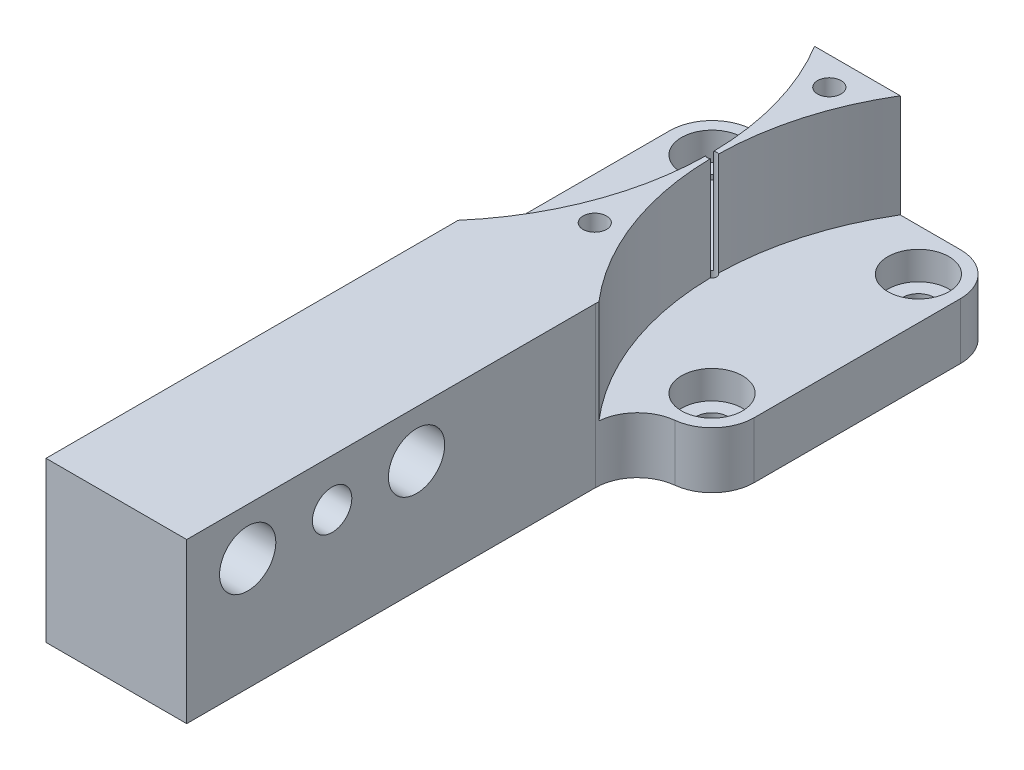
ISO-10303-21;
HEADER;
FILE_DESCRIPTION(('STEP AP214'),'2;1');
FILE_NAME('part.step','',(''),(''),'','','');
FILE_SCHEMA(('AUTOMOTIVE_DESIGN { 1 0 10303 214 1 1 1 1 }'));
ENDSEC;
DATA;
#1=APPLICATION_CONTEXT('core data for automotive mechanical design processes');
#2=APPLICATION_PROTOCOL_DEFINITION('international standard','automotive_design',2000,#1);
#3=PRODUCT_CONTEXT('',#1,'mechanical');
#4=PRODUCT('Part','Part','',(#3));
#5=PRODUCT_RELATED_PRODUCT_CATEGORY('part','',(#4));
#6=PRODUCT_DEFINITION_FORMATION('','',#4);
#7=PRODUCT_DEFINITION_CONTEXT('part definition',#1,'design');
#8=PRODUCT_DEFINITION('design','',#6,#7);
#9=PRODUCT_DEFINITION_SHAPE('','',#8);
#10=(LENGTH_UNIT() NAMED_UNIT(*) SI_UNIT(.MILLI.,.METRE.));
#11=(NAMED_UNIT(*) PLANE_ANGLE_UNIT() SI_UNIT($,.RADIAN.));
#12=(NAMED_UNIT(*) SI_UNIT($,.STERADIAN.) SOLID_ANGLE_UNIT());
#13=UNCERTAINTY_MEASURE_WITH_UNIT(LENGTH_MEASURE(1.E-05),#10,'distance_accuracy_value','');
#14=(GEOMETRIC_REPRESENTATION_CONTEXT(3) GLOBAL_UNCERTAINTY_ASSIGNED_CONTEXT((#13)) GLOBAL_UNIT_ASSIGNED_CONTEXT((#10,
#11,#12)) REPRESENTATION_CONTEXT('',''));
#15=CARTESIAN_POINT('',(0.,0.,0.));
#16=DIRECTION('',(0.,0.,1.));
#17=DIRECTION('',(1.,0.,0.));
#18=AXIS2_PLACEMENT_3D('',#15,#16,#17);
#19=CARTESIAN_POINT('',(30.25,11.,0.));
#20=DIRECTION('',(0.,-1.,0.));
#21=DIRECTION('',(0.,0.,-1.));
#22=AXIS2_PLACEMENT_3D('',#19,#20,#21);
#23=CYLINDRICAL_SURFACE('',#22,30.);
#24=DIRECTION('',(0.,-1.,0.));
#25=VECTOR('',#24,1.);
#26=CARTESIAN_POINT('',(4.56440092191735,11.,-15.5));
#27=LINE('',#26,#25);
#28=CARTESIAN_POINT('',(4.56440092191735,11.,-15.5));
#29=VERTEX_POINT('',#28);
#30=CARTESIAN_POINT('',(4.56440092191735,0.,-15.5));
#31=VERTEX_POINT('',#30);
#32=EDGE_CURVE('E393',#29,#31,#27,.T.);
#33=ORIENTED_EDGE('',*,*,#32,.F.);
#34=CARTESIAN_POINT('',(30.25,11.,0.));
#35=DIRECTION('',(0.,-1.,0.));
#36=DIRECTION('',(0.,0.,1.));
#37=AXIS2_PLACEMENT_3D('',#34,#35,#36);
#38=CIRCLE('',#37,30.);
#39=CARTESIAN_POINT('',(0.253099173553696,11.,-0.431208543916322));
#40=VERTEX_POINT('',#39);
#41=EDGE_CURVE('E526',#40,#29,#38,.T.);
#42=ORIENTED_EDGE('',*,*,#41,.F.);
#43=DIRECTION('',(0.,1.,0.));
#44=VECTOR('',#43,1.);
#45=CARTESIAN_POINT('',(0.253099173553695,2.5,-0.43120854391632));
#46=LINE('',#45,#44);
#47=CARTESIAN_POINT('',(0.25309917355372,0.,-0.431208543916362));
#48=VERTEX_POINT('',#47);
#49=EDGE_CURVE('E445',#40,#48,#46,.F.);
#50=ORIENTED_EDGE('',*,*,#49,.T.);
#51=CARTESIAN_POINT('',(30.25,0.,0.));
#52=DIRECTION('',(0.,-1.,0.));
#53=DIRECTION('',(0.,0.,1.));
#54=AXIS2_PLACEMENT_3D('',#51,#52,#53);
#55=CIRCLE('',#54,30.);
#56=EDGE_CURVE('E513',#48,#31,#55,.T.);
#57=ORIENTED_EDGE('',*,*,#56,.T.);
#58=EDGE_LOOP('',(#33,#42,#50,#57));
#59=FACE_BOUND('',#58,.T.);
#60=ADVANCED_FACE('F56',(#59),#23,.F.);
#61=CARTESIAN_POINT('',(30.25,11.,0.));
#62=DIRECTION('',(0.,1.,0.));
#63=DIRECTION('',(0.,0.,1.));
#64=AXIS2_PLACEMENT_3D('',#61,#62,#63);
#65=PLANE('',#64);
#66=CARTESIAN_POINT('',(0.,11.,-12.5));
#67=DIRECTION('',(0.,1.,0.));
#68=DIRECTION('',(0.,0.,1.));
#69=AXIS2_PLACEMENT_3D('',#66,#67,#68);
#70=CIRCLE('',#69,1.25);
#71=CARTESIAN_POINT('',(0.,11.,-11.25));
#72=VERTEX_POINT('',#71);
#73=EDGE_CURVE('E585',#72,#72,#70,.T.);
#74=ORIENTED_EDGE('',*,*,#73,.F.);
#75=EDGE_LOOP('',(#74));
#76=FACE_BOUND('',#75,.T.);
#77=ORIENTED_EDGE('',*,*,#41,.T.);
#78=DIRECTION('',(-1.,0.,0.));
#79=VECTOR('',#78,1.);
#80=CARTESIAN_POINT('',(-11.,11.,-15.5));
#81=LINE('',#80,#79);
#82=CARTESIAN_POINT('',(-4.56440092191735,11.,-15.5));
#83=VERTEX_POINT('',#82);
#84=EDGE_CURVE('E563',#29,#83,#81,.T.);
#85=ORIENTED_EDGE('',*,*,#84,.T.);
#86=CARTESIAN_POINT('',(-30.25,11.,0.));
#87=DIRECTION('',(0.,-1.,0.));
#88=DIRECTION('',(0.,0.,1.));
#89=AXIS2_PLACEMENT_3D('',#86,#87,#88);
#90=CIRCLE('',#89,30.);
#91=CARTESIAN_POINT('',(-0.25309917355372,11.,-0.431208543916319));
#92=VERTEX_POINT('',#91);
#93=EDGE_CURVE('E535',#83,#92,#90,.T.);
#94=ORIENTED_EDGE('',*,*,#93,.T.);
#95=CARTESIAN_POINT('',(0.,11.,0.));
#96=DIRECTION('',(0.,1.,0.));
#97=DIRECTION('',(0.,0.,1.));
#98=AXIS2_PLACEMENT_3D('',#95,#96,#97);
#99=CIRCLE('',#98,0.499999999999998);
#100=EDGE_CURVE('E432',#40,#92,#99,.T.);
#101=ORIENTED_EDGE('',*,*,#100,.F.);
#102=EDGE_LOOP('',(#77,#85,#94,#101));
#103=FACE_BOUND('',#102,.T.);
#104=ADVANCED_FACE('F595',(#76,#103),#65,.T.);
#105=CARTESIAN_POINT('',(-30.25,11.,0.));
#106=DIRECTION('',(0.,-1.,0.));
#107=DIRECTION('',(0.,0.,-1.));
#108=AXIS2_PLACEMENT_3D('',#105,#106,#107);
#109=CYLINDRICAL_SURFACE('',#108,30.);
#110=DIRECTION('',(0.,1.,0.));
#111=VECTOR('',#110,1.);
#112=CARTESIAN_POINT('',(-7.51527842224712,2.5,19.5737690489609));
#113=LINE('',#112,#111);
#114=CARTESIAN_POINT('',(-7.51527842224712,11.,19.5737690489609));
#115=VERTEX_POINT('',#114);
#116=CARTESIAN_POINT('',(-7.51527842224713,0.,19.5737690489609));
#117=VERTEX_POINT('',#116);
#118=EDGE_CURVE('E382',#115,#117,#113,.F.);
#119=ORIENTED_EDGE('',*,*,#118,.F.);
#120=CARTESIAN_POINT('',(-0.253099173553696,11.,0.431208543916322));
#121=VERTEX_POINT('',#120);
#122=EDGE_CURVE('E532',#121,#115,#90,.T.);
#123=ORIENTED_EDGE('',*,*,#122,.F.);
#124=DIRECTION('',(0.,1.,0.));
#125=VECTOR('',#124,1.);
#126=CARTESIAN_POINT('',(-0.253099173553695,2.5,0.43120854391632));
#127=LINE('',#126,#125);
#128=CARTESIAN_POINT('',(-0.25309917355372,0.,0.431208543916362));
#129=VERTEX_POINT('',#128);
#130=EDGE_CURVE('E65',#121,#129,#127,.F.);
#131=ORIENTED_EDGE('',*,*,#130,.T.);
#132=CARTESIAN_POINT('',(-30.25,0.,0.));
#133=DIRECTION('',(0.,-1.,0.));
#134=DIRECTION('',(0.,0.,1.));
#135=AXIS2_PLACEMENT_3D('',#132,#133,#134);
#136=CIRCLE('',#135,30.);
#137=EDGE_CURVE('E520',#129,#117,#136,.T.);
#138=ORIENTED_EDGE('',*,*,#137,.T.);
#139=EDGE_LOOP('',(#119,#123,#131,#138));
#140=FACE_BOUND('',#139,.T.);
#141=ADVANCED_FACE('F598',(#140),#109,.F.);
#142=CARTESIAN_POINT('',(0.,0.,0.));
#143=DIRECTION('',(0.,1.,0.));
#144=DIRECTION('',(0.,0.,1.));
#145=AXIS2_PLACEMENT_3D('',#142,#143,#144);
#146=PLANE('',#145);
#147=CARTESIAN_POINT('',(-11.,0.,-11.));
#148=DIRECTION('',(0.,1.,0.));
#149=DIRECTION('',(0.,0.,1.));
#150=AXIS2_PLACEMENT_3D('',#147,#148,#149);
#151=CIRCLE('',#150,3.25);
#152=CARTESIAN_POINT('',(-11.,0.,-7.75));
#153=VERTEX_POINT('',#152);
#154=EDGE_CURVE('E449',#153,#153,#151,.T.);
#155=ORIENTED_EDGE('',*,*,#154,.F.);
#156=EDGE_LOOP('',(#155));
#157=FACE_BOUND('',#156,.T.);
#158=CARTESIAN_POINT('',(-11.,0.,11.));
#159=DIRECTION('',(0.,1.,0.));
#160=DIRECTION('',(0.,0.,1.));
#161=AXIS2_PLACEMENT_3D('',#158,#159,#160);
#162=CIRCLE('',#161,3.25);
#163=CARTESIAN_POINT('',(-11.,0.,14.25));
#164=VERTEX_POINT('',#163);
#165=EDGE_CURVE('E497',#164,#164,#162,.T.);
#166=ORIENTED_EDGE('',*,*,#165,.F.);
#167=EDGE_LOOP('',(#166));
#168=FACE_BOUND('',#167,.T.);
#169=CARTESIAN_POINT('',(-11.,0.,11.));
#170=DIRECTION('',(0.,1.,0.));
#171=DIRECTION('',(0.,0.,1.));
#172=AXIS2_PLACEMENT_3D('',#169,#170,#171);
#173=CIRCLE('',#172,4.5);
#174=CARTESIAN_POINT('',(-15.5,0.,11.));
#175=VERTEX_POINT('',#174);
#176=CARTESIAN_POINT('',(-11.5,0.,15.4721359549996));
#177=VERTEX_POINT('',#176);
#178=EDGE_CURVE('E414',#175,#177,#173,.T.);
#179=ORIENTED_EDGE('',*,*,#178,.T.);
#180=CARTESIAN_POINT('',(-12.,0.,19.9442719099992));
#181=DIRECTION('',(0.,1.,0.));
#182=DIRECTION('',(0.,0.,1.));
#183=AXIS2_PLACEMENT_3D('',#180,#181,#182);
#184=CIRCLE('',#183,4.5);
#185=EDGE_CURVE('E311',#177,#117,#184,.F.);
#186=ORIENTED_EDGE('',*,*,#185,.T.);
#187=ORIENTED_EDGE('',*,*,#137,.F.);
#188=CARTESIAN_POINT('',(0.,0.,0.));
#189=DIRECTION('',(0.,1.,0.));
#190=DIRECTION('',(0.,0.,1.));
#191=AXIS2_PLACEMENT_3D('',#188,#189,#190);
#192=CIRCLE('',#191,0.499999999999997);
#193=CARTESIAN_POINT('',(-0.25309917355372,0.,-0.431208543916319));
#194=VERTEX_POINT('',#193);
#195=EDGE_CURVE('E436',#194,#129,#192,.T.);
#196=ORIENTED_EDGE('',*,*,#195,.F.);
#197=CARTESIAN_POINT('',(-4.56440092191735,0.,-15.5));
#198=VERTEX_POINT('',#197);
#199=EDGE_CURVE('E523',#198,#194,#136,.T.);
#200=ORIENTED_EDGE('',*,*,#199,.F.);
#201=DIRECTION('',(-1.,0.,0.));
#202=VECTOR('',#201,1.);
#203=CARTESIAN_POINT('',(0.,0.,-15.5));
#204=LINE('',#203,#202);
#205=CARTESIAN_POINT('',(-11.,0.,-15.5));
#206=VERTEX_POINT('',#205);
#207=EDGE_CURVE('E385',#198,#206,#204,.T.);
#208=ORIENTED_EDGE('',*,*,#207,.T.);
#209=CARTESIAN_POINT('',(-11.,0.,-11.));
#210=DIRECTION('',(0.,1.,0.));
#211=DIRECTION('',(0.,0.,1.));
#212=AXIS2_PLACEMENT_3D('',#209,#210,#211);
#213=CIRCLE('',#212,4.5);
#214=CARTESIAN_POINT('',(-15.5,0.,-11.));
#215=VERTEX_POINT('',#214);
#216=EDGE_CURVE('E406',#206,#215,#213,.T.);
#217=ORIENTED_EDGE('',*,*,#216,.T.);
#218=DIRECTION('',(0.,0.,1.));
#219=VECTOR('',#218,1.);
#220=CARTESIAN_POINT('',(-15.5,0.,0.));
#221=LINE('',#220,#219);
#222=EDGE_CURVE('E410',#215,#175,#221,.T.);
#223=ORIENTED_EDGE('',*,*,#222,.T.);
#224=EDGE_LOOP('',(#179,#186,#187,#196,#200,#208,#217,#223));
#225=FACE_BOUND('',#224,.T.);
#226=ADVANCED_FACE('F620',(#157,#168,#225),#146,.T.);
#227=CARTESIAN_POINT('',(0.,-6.,0.));
#228=DIRECTION('',(0.,1.,0.));
#229=DIRECTION('',(0.,0.,1.));
#230=AXIS2_PLACEMENT_3D('',#227,#228,#229);
#231=PLANE('',#230);
#232=CARTESIAN_POINT('',(0.,-6.,-12.5));
#233=DIRECTION('',(0.,1.,0.));
#234=DIRECTION('',(0.,0.,1.));
#235=AXIS2_PLACEMENT_3D('',#232,#233,#234);
#236=CIRCLE('',#235,1.25);
#237=CARTESIAN_POINT('',(0.,-6.,-11.25));
#238=VERTEX_POINT('',#237);
#239=EDGE_CURVE('E580',#238,#238,#236,.T.);
#240=ORIENTED_EDGE('',*,*,#239,.T.);
#241=EDGE_LOOP('',(#240));
#242=FACE_BOUND('',#241,.T.);
#243=CARTESIAN_POINT('',(0.,-6.,12.5));
#244=DIRECTION('',(0.,1.,0.));
#245=DIRECTION('',(0.,0.,1.));
#246=AXIS2_PLACEMENT_3D('',#243,#244,#245);
#247=CIRCLE('',#246,1.25);
#248=CARTESIAN_POINT('',(0.,-6.,13.75));
#249=VERTEX_POINT('',#248);
#250=EDGE_CURVE('E282',#249,#249,#247,.T.);
#251=ORIENTED_EDGE('',*,*,#250,.T.);
#252=EDGE_LOOP('',(#251));
#253=FACE_BOUND('',#252,.T.);
#254=CARTESIAN_POINT('',(-11.,-6.,11.));
#255=DIRECTION('',(0.,1.,0.));
#256=DIRECTION('',(0.,0.,1.));
#257=AXIS2_PLACEMENT_3D('',#254,#255,#256);
#258=CIRCLE('',#257,1.7);
#259=CARTESIAN_POINT('',(-11.,-6.,12.7));
#260=VERTEX_POINT('',#259);
#261=EDGE_CURVE('E509',#260,#260,#258,.T.);
#262=ORIENTED_EDGE('',*,*,#261,.T.);
#263=EDGE_LOOP('',(#262));
#264=FACE_BOUND('',#263,.T.);
#265=CARTESIAN_POINT('',(11.,-6.,11.));
#266=DIRECTION('',(0.,1.,0.));
#267=DIRECTION('',(0.,0.,1.));
#268=AXIS2_PLACEMENT_3D('',#265,#266,#267);
#269=CIRCLE('',#268,1.7);
#270=CARTESIAN_POINT('',(11.,-6.,12.7));
#271=VERTEX_POINT('',#270);
#272=EDGE_CURVE('E493',#271,#271,#269,.T.);
#273=ORIENTED_EDGE('',*,*,#272,.T.);
#274=EDGE_LOOP('',(#273));
#275=FACE_BOUND('',#274,.T.);
#276=CARTESIAN_POINT('',(11.,-6.,-11.));
#277=DIRECTION('',(0.,1.,0.));
#278=DIRECTION('',(0.,0.,1.));
#279=AXIS2_PLACEMENT_3D('',#276,#277,#278);
#280=CIRCLE('',#279,1.7);
#281=CARTESIAN_POINT('',(11.,-6.,-9.3));
#282=VERTEX_POINT('',#281);
#283=EDGE_CURVE('E477',#282,#282,#280,.T.);
#284=ORIENTED_EDGE('',*,*,#283,.T.);
#285=EDGE_LOOP('',(#284));
#286=FACE_BOUND('',#285,.T.);
#287=CARTESIAN_POINT('',(-11.,-6.,-11.));
#288=DIRECTION('',(0.,1.,0.));
#289=DIRECTION('',(0.,0.,1.));
#290=AXIS2_PLACEMENT_3D('',#287,#288,#289);
#291=CIRCLE('',#290,1.7);
#292=CARTESIAN_POINT('',(-11.,-6.,-9.3));
#293=VERTEX_POINT('',#292);
#294=EDGE_CURVE('E461',#293,#293,#291,.T.);
#295=ORIENTED_EDGE('',*,*,#294,.T.);
#296=EDGE_LOOP('',(#295));
#297=FACE_BOUND('',#296,.T.);
#298=CARTESIAN_POINT('',(0.,-6.,0.));
#299=DIRECTION('',(0.,-1.,0.));
#300=DIRECTION('',(0.,0.,-1.));
#301=AXIS2_PLACEMENT_3D('',#298,#299,#300);
#302=CIRCLE('',#301,1.5);
#303=CARTESIAN_POINT('',(0.,-6.,-1.5));
#304=VERTEX_POINT('',#303);
#305=EDGE_CURVE('E417',#304,#304,#302,.T.);
#306=ORIENTED_EDGE('',*,*,#305,.F.);
#307=EDGE_LOOP('',(#306));
#308=FACE_BOUND('',#307,.T.);
#309=DIRECTION('',(1.,0.,0.));
#310=VECTOR('',#309,1.);
#311=CARTESIAN_POINT('',(-7.50000000000003,-6.,63.5));
#312=LINE('',#311,#310);
#313=CARTESIAN_POINT('',(-7.50000000000003,-6.,63.5));
#314=VERTEX_POINT('',#313);
#315=CARTESIAN_POINT('',(7.49999999999997,-6.,63.5));
#316=VERTEX_POINT('',#315);
#317=EDGE_CURVE('E72',#314,#316,#312,.T.);
#318=ORIENTED_EDGE('',*,*,#317,.F.);
#319=DIRECTION('',(0.,0.,1.));
#320=VECTOR('',#319,1.);
#321=CARTESIAN_POINT('',(-7.50000000000003,-6.,63.5));
#322=LINE('',#321,#320);
#323=CARTESIAN_POINT('',(-7.50000000000002,-6.,19.9442719099992));
#324=VERTEX_POINT('',#323);
#325=EDGE_CURVE('E265',#324,#314,#322,.T.);
#326=ORIENTED_EDGE('',*,*,#325,.F.);
#327=CARTESIAN_POINT('',(-12.,-6.,19.9442719099992));
#328=DIRECTION('',(0.,-1.,0.));
#329=DIRECTION('',(0.,0.,1.));
#330=AXIS2_PLACEMENT_3D('',#327,#328,#329);
#331=CIRCLE('',#330,4.5);
#332=CARTESIAN_POINT('',(-11.5,-6.,15.4721359549996));
#333=VERTEX_POINT('',#332);
#334=EDGE_CURVE('E260',#333,#324,#331,.T.);
#335=ORIENTED_EDGE('',*,*,#334,.F.);
#336=CARTESIAN_POINT('',(-11.,-6.,11.));
#337=DIRECTION('',(0.,1.,0.));
#338=DIRECTION('',(0.,0.,1.));
#339=AXIS2_PLACEMENT_3D('',#336,#337,#338);
#340=CIRCLE('',#339,4.5);
#341=CARTESIAN_POINT('',(-15.5,-6.,11.));
#342=VERTEX_POINT('',#341);
#343=EDGE_CURVE('E256',#342,#333,#340,.T.);
#344=ORIENTED_EDGE('',*,*,#343,.F.);
#345=DIRECTION('',(0.,0.,1.));
#346=VECTOR('',#345,1.);
#347=CARTESIAN_POINT('',(-15.5,-6.,-11.));
#348=LINE('',#347,#346);
#349=CARTESIAN_POINT('',(-15.5,-6.,-11.));
#350=VERTEX_POINT('',#349);
#351=EDGE_CURVE('E248',#350,#342,#348,.T.);
#352=ORIENTED_EDGE('',*,*,#351,.F.);
#353=CARTESIAN_POINT('',(-11.,-6.,-11.));
#354=DIRECTION('',(0.,1.,0.));
#355=DIRECTION('',(0.,0.,1.));
#356=AXIS2_PLACEMENT_3D('',#353,#354,#355);
#357=CIRCLE('',#356,4.5);
#358=CARTESIAN_POINT('',(-11.,-6.,-15.5));
#359=VERTEX_POINT('',#358);
#360=EDGE_CURVE('E243',#359,#350,#357,.T.);
#361=ORIENTED_EDGE('',*,*,#360,.F.);
#362=DIRECTION('',(-1.,0.,0.));
#363=VECTOR('',#362,1.);
#364=CARTESIAN_POINT('',(-11.,-6.,-15.5));
#365=LINE('',#364,#363);
#366=CARTESIAN_POINT('',(11.,-6.,-15.5));
#367=VERTEX_POINT('',#366);
#368=EDGE_CURVE('E238',#367,#359,#365,.T.);
#369=ORIENTED_EDGE('',*,*,#368,.F.);
#370=CARTESIAN_POINT('',(11.,-6.,-11.));
#371=DIRECTION('',(0.,1.,0.));
#372=DIRECTION('',(0.,0.,1.));
#373=AXIS2_PLACEMENT_3D('',#370,#371,#372);
#374=CIRCLE('',#373,4.5);
#375=CARTESIAN_POINT('',(15.5,-6.,-11.));
#376=VERTEX_POINT('',#375);
#377=EDGE_CURVE('E223',#376,#367,#374,.T.);
#378=ORIENTED_EDGE('',*,*,#377,.F.);
#379=DIRECTION('',(0.,0.,-1.));
#380=VECTOR('',#379,1.);
#381=CARTESIAN_POINT('',(15.5,-6.,-11.));
#382=LINE('',#381,#380);
#383=CARTESIAN_POINT('',(15.5,-6.,11.));
#384=VERTEX_POINT('',#383);
#385=EDGE_CURVE('E219',#384,#376,#382,.T.);
#386=ORIENTED_EDGE('',*,*,#385,.F.);
#387=CARTESIAN_POINT('',(11.,-6.,11.));
#388=DIRECTION('',(0.,1.,0.));
#389=DIRECTION('',(0.,0.,1.));
#390=AXIS2_PLACEMENT_3D('',#387,#388,#389);
#391=CIRCLE('',#390,4.5);
#392=CARTESIAN_POINT('',(11.5,-6.,15.4721359549996));
#393=VERTEX_POINT('',#392);
#394=EDGE_CURVE('E198',#393,#384,#391,.T.);
#395=ORIENTED_EDGE('',*,*,#394,.F.);
#396=CARTESIAN_POINT('',(12.,-6.,19.9442719099992));
#397=DIRECTION('',(0.,-1.,0.));
#398=DIRECTION('',(0.,0.,1.));
#399=AXIS2_PLACEMENT_3D('',#396,#397,#398);
#400=CIRCLE('',#399,4.5);
#401=CARTESIAN_POINT('',(7.49999999999998,-6.,19.9442719099992));
#402=VERTEX_POINT('',#401);
#403=EDGE_CURVE('E208',#402,#393,#400,.T.);
#404=ORIENTED_EDGE('',*,*,#403,.F.);
#405=DIRECTION('',(0.,0.,-1.));
#406=VECTOR('',#405,1.);
#407=CARTESIAN_POINT('',(7.49999999999997,-6.,63.5));
#408=LINE('',#407,#406);
#409=EDGE_CURVE('E214',#316,#402,#408,.T.);
#410=ORIENTED_EDGE('',*,*,#409,.F.);
#411=EDGE_LOOP('',(#318,#326,#335,#344,#352,#361,#369,#378,#386,#395,#404,#410));
#412=FACE_BOUND('',#411,.T.);
#413=ADVANCED_FACE('F216',(#242,#253,#264,#275,#286,#297,#308,#412),#231,.F.);
#414=DIRECTION('',(0.,1.,0.));
#415=VECTOR('',#414,1.);
#416=CARTESIAN_POINT('',(7.51527842224709,2.5,19.5737690489608));
#417=LINE('',#416,#415);
#418=CARTESIAN_POINT('',(7.51527842224709,0.,19.5737690489608));
#419=VERTEX_POINT('',#418);
#420=CARTESIAN_POINT('',(7.51527842224709,11.,19.5737690489608));
#421=VERTEX_POINT('',#420);
#422=EDGE_CURVE('E374',#419,#421,#417,.T.);
#423=ORIENTED_EDGE('',*,*,#422,.F.);
#424=CARTESIAN_POINT('',(0.25309917355372,0.,0.431208543916329));
#425=VERTEX_POINT('',#424);
#426=EDGE_CURVE('E517',#419,#425,#55,.T.);
#427=ORIENTED_EDGE('',*,*,#426,.T.);
#428=DIRECTION('',(0.,1.,0.));
#429=VECTOR('',#428,1.);
#430=CARTESIAN_POINT('',(0.253099173553695,2.5,0.43120854391632));
#431=LINE('',#430,#429);
#432=CARTESIAN_POINT('',(0.253099173553696,11.,0.431208543916322));
#433=VERTEX_POINT('',#432);
#434=EDGE_CURVE('E438',#425,#433,#431,.T.);
#435=ORIENTED_EDGE('',*,*,#434,.T.);
#436=EDGE_CURVE('E529',#421,#433,#38,.T.);
#437=ORIENTED_EDGE('',*,*,#436,.F.);
#438=EDGE_LOOP('',(#423,#427,#435,#437));
#439=FACE_BOUND('',#438,.T.);
#440=ADVANCED_FACE('F632',(#439),#23,.F.);
#441=DIRECTION('',(0.,-1.,0.));
#442=VECTOR('',#441,1.);
#443=CARTESIAN_POINT('',(-4.56440092191735,11.,-15.5));
#444=LINE('',#443,#442);
#445=EDGE_CURVE('E12',#198,#83,#444,.F.);
#446=ORIENTED_EDGE('',*,*,#445,.F.);
#447=ORIENTED_EDGE('',*,*,#199,.T.);
#448=DIRECTION('',(0.,1.,0.));
#449=VECTOR('',#448,1.);
#450=CARTESIAN_POINT('',(-0.253099173553695,2.5,-0.43120854391632));
#451=LINE('',#450,#449);
#452=EDGE_CURVE('E538',#194,#92,#451,.T.);
#453=ORIENTED_EDGE('',*,*,#452,.T.);
#454=ORIENTED_EDGE('',*,*,#93,.F.);
#455=EDGE_LOOP('',(#446,#447,#453,#454));
#456=FACE_BOUND('',#455,.T.);
#457=ADVANCED_FACE('F624',(#456),#109,.F.);
#458=CARTESIAN_POINT('',(0.,11.,12.5));
#459=DIRECTION('',(0.,1.,0.));
#460=DIRECTION('',(0.,0.,1.));
#461=AXIS2_PLACEMENT_3D('',#458,#459,#460);
#462=CIRCLE('',#461,1.25);
#463=CARTESIAN_POINT('',(0.,11.,13.75));
#464=VERTEX_POINT('',#463);
#465=EDGE_CURVE('E575',#464,#464,#462,.T.);
#466=ORIENTED_EDGE('',*,*,#465,.F.);
#467=EDGE_LOOP('',(#466));
#468=FACE_BOUND('',#467,.T.);
#469=ORIENTED_EDGE('',*,*,#122,.T.);
#470=CARTESIAN_POINT('',(-12.,11.,19.9442719099992));
#471=DIRECTION('',(0.,-1.,0.));
#472=DIRECTION('',(0.,0.,1.));
#473=AXIS2_PLACEMENT_3D('',#470,#471,#472);
#474=CIRCLE('',#473,4.5);
#475=CARTESIAN_POINT('',(-7.50000000000002,11.,19.9442719099992));
#476=VERTEX_POINT('',#475);
#477=EDGE_CURVE('E560',#115,#476,#474,.T.);
#478=ORIENTED_EDGE('',*,*,#477,.T.);
#479=DIRECTION('',(0.,0.,1.));
#480=VECTOR('',#479,1.);
#481=CARTESIAN_POINT('',(-7.50000000000003,11.,63.5));
#482=LINE('',#481,#480);
#483=CARTESIAN_POINT('',(-7.50000000000003,11.,63.5));
#484=VERTEX_POINT('',#483);
#485=EDGE_CURVE('E281',#476,#484,#482,.T.);
#486=ORIENTED_EDGE('',*,*,#485,.T.);
#487=DIRECTION('',(1.,0.,0.));
#488=VECTOR('',#487,1.);
#489=CARTESIAN_POINT('',(-7.50000000000003,11.,63.5));
#490=LINE('',#489,#488);
#491=CARTESIAN_POINT('',(7.49999999999997,11.,63.5));
#492=VERTEX_POINT('',#491);
#493=EDGE_CURVE('E271',#484,#492,#490,.T.);
#494=ORIENTED_EDGE('',*,*,#493,.T.);
#495=DIRECTION('',(0.,0.,-1.));
#496=VECTOR('',#495,1.);
#497=CARTESIAN_POINT('',(7.49999999999997,11.,63.5));
#498=LINE('',#497,#496);
#499=CARTESIAN_POINT('',(7.49999999999998,11.,19.9442719099992));
#500=VERTEX_POINT('',#499);
#501=EDGE_CURVE('E568',#492,#500,#498,.T.);
#502=ORIENTED_EDGE('',*,*,#501,.T.);
#503=CARTESIAN_POINT('',(12.,11.,19.9442719099992));
#504=DIRECTION('',(0.,-1.,0.));
#505=DIRECTION('',(0.,0.,1.));
#506=AXIS2_PLACEMENT_3D('',#503,#504,#505);
#507=CIRCLE('',#506,4.5);
#508=EDGE_CURVE('E80',#500,#421,#507,.T.);
#509=ORIENTED_EDGE('',*,*,#508,.T.);
#510=ORIENTED_EDGE('',*,*,#436,.T.);
#511=EDGE_CURVE('E428',#121,#433,#99,.T.);
#512=ORIENTED_EDGE('',*,*,#511,.F.);
#513=EDGE_LOOP('',(#469,#478,#486,#494,#502,#509,#510,#512));
#514=FACE_BOUND('',#513,.T.);
#515=ADVANCED_FACE('F600',(#468,#514),#65,.T.);
#516=CARTESIAN_POINT('',(0.,11.,0.));
#517=DIRECTION('',(0.,1.,0.));
#518=DIRECTION('',(0.,0.,1.));
#519=AXIS2_PLACEMENT_3D('',#516,#517,#518);
#520=CYLINDRICAL_SURFACE('',#519,0.499999999999997);
#521=ORIENTED_EDGE('',*,*,#100,.T.);
#522=ORIENTED_EDGE('',*,*,#452,.F.);
#523=ORIENTED_EDGE('',*,*,#195,.T.);
#524=ORIENTED_EDGE('',*,*,#130,.F.);
#525=ORIENTED_EDGE('',*,*,#511,.T.);
#526=ORIENTED_EDGE('',*,*,#434,.F.);
#527=CARTESIAN_POINT('',(0.,0.,0.));
#528=DIRECTION('',(0.,1.,0.));
#529=DIRECTION('',(0.,0.,1.));
#530=AXIS2_PLACEMENT_3D('',#527,#528,#529);
#531=CIRCLE('',#530,0.499999999999997);
#532=EDGE_CURVE('E442',#425,#48,#531,.T.);
#533=ORIENTED_EDGE('',*,*,#532,.T.);
#534=ORIENTED_EDGE('',*,*,#49,.F.);
#535=EDGE_LOOP('',(#521,#522,#523,#524,#525,#526,#533,#534));
#536=FACE_BOUND('',#535,.T.);
#537=CARTESIAN_POINT('',(0.,-1.,0.));
#538=DIRECTION('',(0.,-1.,0.));
#539=DIRECTION('',(0.,0.,-1.));
#540=AXIS2_PLACEMENT_3D('',#537,#538,#539);
#541=CIRCLE('',#540,0.499999999999997);
#542=CARTESIAN_POINT('',(0.,-1.,-0.499999999999997));
#543=VERTEX_POINT('',#542);
#544=EDGE_CURVE('E424',#543,#543,#541,.F.);
#545=ORIENTED_EDGE('',*,*,#544,.F.);
#546=EDGE_LOOP('',(#545));
#547=FACE_BOUND('',#546,.T.);
#548=ADVANCED_FACE('F626',(#536,#547),#520,.F.);
#549=CARTESIAN_POINT('',(11.,0.,-11.));
#550=DIRECTION('',(0.,1.,0.));
#551=DIRECTION('',(0.,0.,1.));
#552=AXIS2_PLACEMENT_3D('',#549,#550,#551);
#553=CIRCLE('',#552,4.5);
#554=CARTESIAN_POINT('',(15.5,0.,-11.));
#555=VERTEX_POINT('',#554);
#556=CARTESIAN_POINT('',(11.,0.,-15.5));
#557=VERTEX_POINT('',#556);
#558=EDGE_CURVE('E402',#555,#557,#553,.T.);
#559=ORIENTED_EDGE('',*,*,#558,.T.);
#560=DIRECTION('',(-1.,0.,0.));
#561=VECTOR('',#560,1.);
#562=CARTESIAN_POINT('',(0.,0.,-15.5));
#563=LINE('',#562,#561);
#564=EDGE_CURVE('E389',#557,#31,#563,.T.);
#565=ORIENTED_EDGE('',*,*,#564,.T.);
#566=ORIENTED_EDGE('',*,*,#56,.F.);
#567=ORIENTED_EDGE('',*,*,#532,.F.);
#568=ORIENTED_EDGE('',*,*,#426,.F.);
#569=CARTESIAN_POINT('',(12.,0.,19.9442719099992));
#570=DIRECTION('',(0.,1.,0.));
#571=DIRECTION('',(0.,0.,1.));
#572=AXIS2_PLACEMENT_3D('',#569,#570,#571);
#573=CIRCLE('',#572,4.5);
#574=CARTESIAN_POINT('',(11.5,0.,15.4721359549996));
#575=VERTEX_POINT('',#574);
#576=EDGE_CURVE('E377',#419,#575,#573,.F.);
#577=ORIENTED_EDGE('',*,*,#576,.T.);
#578=CARTESIAN_POINT('',(11.,0.,11.));
#579=DIRECTION('',(0.,1.,0.));
#580=DIRECTION('',(0.,0.,1.));
#581=AXIS2_PLACEMENT_3D('',#578,#579,#580);
#582=CIRCLE('',#581,4.5);
#583=CARTESIAN_POINT('',(15.5,0.,11.));
#584=VERTEX_POINT('',#583);
#585=EDGE_CURVE('E201',#575,#584,#582,.T.);
#586=ORIENTED_EDGE('',*,*,#585,.T.);
#587=DIRECTION('',(0.,0.,-1.));
#588=VECTOR('',#587,1.);
#589=CARTESIAN_POINT('',(15.5,0.,0.));
#590=LINE('',#589,#588);
#591=EDGE_CURVE('E398',#584,#555,#590,.T.);
#592=ORIENTED_EDGE('',*,*,#591,.T.);
#593=EDGE_LOOP('',(#559,#565,#566,#567,#568,#577,#586,#592));
#594=FACE_BOUND('',#593,.T.);
#595=CARTESIAN_POINT('',(11.,0.,-11.));
#596=DIRECTION('',(0.,1.,0.));
#597=DIRECTION('',(0.,0.,1.));
#598=AXIS2_PLACEMENT_3D('',#595,#596,#597);
#599=CIRCLE('',#598,3.25);
#600=CARTESIAN_POINT('',(11.,0.,-7.75));
#601=VERTEX_POINT('',#600);
#602=EDGE_CURVE('E465',#601,#601,#599,.T.);
#603=ORIENTED_EDGE('',*,*,#602,.F.);
#604=EDGE_LOOP('',(#603));
#605=FACE_BOUND('',#604,.T.);
#606=CARTESIAN_POINT('',(11.,0.,11.));
#607=DIRECTION('',(0.,1.,0.));
#608=DIRECTION('',(0.,0.,1.));
#609=AXIS2_PLACEMENT_3D('',#606,#607,#608);
#610=CIRCLE('',#609,3.25);
#611=CARTESIAN_POINT('',(11.,0.,14.25));
#612=VERTEX_POINT('',#611);
#613=EDGE_CURVE('E481',#612,#612,#610,.T.);
#614=ORIENTED_EDGE('',*,*,#613,.F.);
#615=EDGE_LOOP('',(#614));
#616=FACE_BOUND('',#615,.T.);
#617=ADVANCED_FACE('F58',(#594,#605,#616),#146,.T.);
#618=CARTESIAN_POINT('',(-11.,0.,11.));
#619=DIRECTION('',(0.,1.,0.));
#620=DIRECTION('',(0.,0.,1.));
#621=AXIS2_PLACEMENT_3D('',#618,#619,#620);
#622=CYLINDRICAL_SURFACE('',#621,1.7);
#623=ORIENTED_EDGE('',*,*,#261,.F.);
#624=EDGE_LOOP('',(#623));
#625=FACE_BOUND('',#624,.T.);
#626=CARTESIAN_POINT('',(-11.,-3.,11.));
#627=DIRECTION('',(0.,1.,0.));
#628=DIRECTION('',(0.,0.,1.));
#629=AXIS2_PLACEMENT_3D('',#626,#627,#628);
#630=CIRCLE('',#629,1.7);
#631=CARTESIAN_POINT('',(-11.,-3.,12.7));
#632=VERTEX_POINT('',#631);
#633=EDGE_CURVE('E505',#632,#632,#630,.T.);
#634=ORIENTED_EDGE('',*,*,#633,.T.);
#635=EDGE_LOOP('',(#634));
#636=FACE_BOUND('',#635,.T.);
#637=ADVANCED_FACE('F736',(#625,#636),#622,.F.);
#638=CARTESIAN_POINT('',(-9.3,-3.,11.));
#639=DIRECTION('',(0.,-1.,0.));
#640=DIRECTION('',(0.,0.,-1.));
#641=AXIS2_PLACEMENT_3D('',#638,#639,#640);
#642=PLANE('',#641);
#643=ORIENTED_EDGE('',*,*,#633,.F.);
#644=EDGE_LOOP('',(#643));
#645=FACE_BOUND('',#644,.T.);
#646=CARTESIAN_POINT('',(-11.,-3.,11.));
#647=DIRECTION('',(0.,1.,0.));
#648=DIRECTION('',(0.,0.,1.));
#649=AXIS2_PLACEMENT_3D('',#646,#647,#648);
#650=CIRCLE('',#649,3.25);
#651=CARTESIAN_POINT('',(-11.,-3.,14.25));
#652=VERTEX_POINT('',#651);
#653=EDGE_CURVE('E501',#652,#652,#650,.T.);
#654=ORIENTED_EDGE('',*,*,#653,.T.);
#655=EDGE_LOOP('',(#654));
#656=FACE_BOUND('',#655,.T.);
#657=ADVANCED_FACE('F732',(#645,#656),#642,.F.);
#658=CARTESIAN_POINT('',(-11.,0.,11.));
#659=DIRECTION('',(0.,1.,0.));
#660=DIRECTION('',(0.,0.,1.));
#661=AXIS2_PLACEMENT_3D('',#658,#659,#660);
#662=CYLINDRICAL_SURFACE('',#661,3.25);
#663=ORIENTED_EDGE('',*,*,#653,.F.);
#664=EDGE_LOOP('',(#663));
#665=FACE_BOUND('',#664,.T.);
#666=ORIENTED_EDGE('',*,*,#165,.T.);
#667=EDGE_LOOP('',(#666));
#668=FACE_BOUND('',#667,.T.);
#669=ADVANCED_FACE('F728',(#665,#668),#662,.F.);
#670=CARTESIAN_POINT('',(11.,0.,11.));
#671=DIRECTION('',(0.,1.,0.));
#672=DIRECTION('',(0.,0.,1.));
#673=AXIS2_PLACEMENT_3D('',#670,#671,#672);
#674=CYLINDRICAL_SURFACE('',#673,1.7);
#675=ORIENTED_EDGE('',*,*,#272,.F.);
#676=EDGE_LOOP('',(#675));
#677=FACE_BOUND('',#676,.T.);
#678=CARTESIAN_POINT('',(11.,-3.,11.));
#679=DIRECTION('',(0.,1.,0.));
#680=DIRECTION('',(0.,0.,1.));
#681=AXIS2_PLACEMENT_3D('',#678,#679,#680);
#682=CIRCLE('',#681,1.7);
#683=CARTESIAN_POINT('',(11.,-3.,12.7));
#684=VERTEX_POINT('',#683);
#685=EDGE_CURVE('E489',#684,#684,#682,.T.);
#686=ORIENTED_EDGE('',*,*,#685,.T.);
#687=EDGE_LOOP('',(#686));
#688=FACE_BOUND('',#687,.T.);
#689=ADVANCED_FACE('F724',(#677,#688),#674,.F.);
#690=CARTESIAN_POINT('',(12.7,-3.,11.));
#691=DIRECTION('',(0.,-1.,0.));
#692=DIRECTION('',(0.,0.,-1.));
#693=AXIS2_PLACEMENT_3D('',#690,#691,#692);
#694=PLANE('',#693);
#695=ORIENTED_EDGE('',*,*,#685,.F.);
#696=EDGE_LOOP('',(#695));
#697=FACE_BOUND('',#696,.T.);
#698=CARTESIAN_POINT('',(11.,-3.,11.));
#699=DIRECTION('',(0.,1.,0.));
#700=DIRECTION('',(0.,0.,1.));
#701=AXIS2_PLACEMENT_3D('',#698,#699,#700);
#702=CIRCLE('',#701,3.25);
#703=CARTESIAN_POINT('',(11.,-3.,14.25));
#704=VERTEX_POINT('',#703);
#705=EDGE_CURVE('E485',#704,#704,#702,.T.);
#706=ORIENTED_EDGE('',*,*,#705,.T.);
#707=EDGE_LOOP('',(#706));
#708=FACE_BOUND('',#707,.T.);
#709=ADVANCED_FACE('F720',(#697,#708),#694,.F.);
#710=CARTESIAN_POINT('',(11.,0.,11.));
#711=DIRECTION('',(0.,1.,0.));
#712=DIRECTION('',(0.,0.,1.));
#713=AXIS2_PLACEMENT_3D('',#710,#711,#712);
#714=CYLINDRICAL_SURFACE('',#713,3.25);
#715=ORIENTED_EDGE('',*,*,#705,.F.);
#716=EDGE_LOOP('',(#715));
#717=FACE_BOUND('',#716,.T.);
#718=ORIENTED_EDGE('',*,*,#613,.T.);
#719=EDGE_LOOP('',(#718));
#720=FACE_BOUND('',#719,.T.);
#721=ADVANCED_FACE('F716',(#717,#720),#714,.F.);
#722=CARTESIAN_POINT('',(11.,0.,-11.));
#723=DIRECTION('',(0.,1.,0.));
#724=DIRECTION('',(0.,0.,1.));
#725=AXIS2_PLACEMENT_3D('',#722,#723,#724);
#726=CYLINDRICAL_SURFACE('',#725,1.7);
#727=ORIENTED_EDGE('',*,*,#283,.F.);
#728=EDGE_LOOP('',(#727));
#729=FACE_BOUND('',#728,.T.);
#730=CARTESIAN_POINT('',(11.,-3.,-11.));
#731=DIRECTION('',(0.,1.,0.));
#732=DIRECTION('',(0.,0.,1.));
#733=AXIS2_PLACEMENT_3D('',#730,#731,#732);
#734=CIRCLE('',#733,1.7);
#735=CARTESIAN_POINT('',(11.,-3.,-9.3));
#736=VERTEX_POINT('',#735);
#737=EDGE_CURVE('E473',#736,#736,#734,.T.);
#738=ORIENTED_EDGE('',*,*,#737,.T.);
#739=EDGE_LOOP('',(#738));
#740=FACE_BOUND('',#739,.T.);
#741=ADVANCED_FACE('F712',(#729,#740),#726,.F.);
#742=CARTESIAN_POINT('',(12.7,-3.,-11.));
#743=DIRECTION('',(0.,-1.,0.));
#744=DIRECTION('',(0.,0.,-1.));
#745=AXIS2_PLACEMENT_3D('',#742,#743,#744);
#746=PLANE('',#745);
#747=ORIENTED_EDGE('',*,*,#737,.F.);
#748=EDGE_LOOP('',(#747));
#749=FACE_BOUND('',#748,.T.);
#750=CARTESIAN_POINT('',(11.,-3.,-11.));
#751=DIRECTION('',(0.,1.,0.));
#752=DIRECTION('',(0.,0.,1.));
#753=AXIS2_PLACEMENT_3D('',#750,#751,#752);
#754=CIRCLE('',#753,3.25);
#755=CARTESIAN_POINT('',(11.,-3.,-7.75));
#756=VERTEX_POINT('',#755);
#757=EDGE_CURVE('E469',#756,#756,#754,.T.);
#758=ORIENTED_EDGE('',*,*,#757,.T.);
#759=EDGE_LOOP('',(#758));
#760=FACE_BOUND('',#759,.T.);
#761=ADVANCED_FACE('F708',(#749,#760),#746,.F.);
#762=CARTESIAN_POINT('',(11.,0.,-11.));
#763=DIRECTION('',(0.,1.,0.));
#764=DIRECTION('',(0.,0.,1.));
#765=AXIS2_PLACEMENT_3D('',#762,#763,#764);
#766=CYLINDRICAL_SURFACE('',#765,3.25);
#767=ORIENTED_EDGE('',*,*,#757,.F.);
#768=EDGE_LOOP('',(#767));
#769=FACE_BOUND('',#768,.T.);
#770=ORIENTED_EDGE('',*,*,#602,.T.);
#771=EDGE_LOOP('',(#770));
#772=FACE_BOUND('',#771,.T.);
#773=ADVANCED_FACE('F704',(#769,#772),#766,.F.);
#774=CARTESIAN_POINT('',(-11.,0.,-11.));
#775=DIRECTION('',(0.,1.,0.));
#776=DIRECTION('',(0.,0.,1.));
#777=AXIS2_PLACEMENT_3D('',#774,#775,#776);
#778=CYLINDRICAL_SURFACE('',#777,1.7);
#779=ORIENTED_EDGE('',*,*,#294,.F.);
#780=EDGE_LOOP('',(#779));
#781=FACE_BOUND('',#780,.T.);
#782=CARTESIAN_POINT('',(-11.,-3.,-11.));
#783=DIRECTION('',(0.,1.,0.));
#784=DIRECTION('',(0.,0.,1.));
#785=AXIS2_PLACEMENT_3D('',#782,#783,#784);
#786=CIRCLE('',#785,1.7);
#787=CARTESIAN_POINT('',(-11.,-3.,-9.3));
#788=VERTEX_POINT('',#787);
#789=EDGE_CURVE('E457',#788,#788,#786,.T.);
#790=ORIENTED_EDGE('',*,*,#789,.T.);
#791=EDGE_LOOP('',(#790));
#792=FACE_BOUND('',#791,.T.);
#793=ADVANCED_FACE('F700',(#781,#792),#778,.F.);
#794=CARTESIAN_POINT('',(-9.3,-3.,-11.));
#795=DIRECTION('',(0.,-1.,0.));
#796=DIRECTION('',(0.,0.,-1.));
#797=AXIS2_PLACEMENT_3D('',#794,#795,#796);
#798=PLANE('',#797);
#799=ORIENTED_EDGE('',*,*,#789,.F.);
#800=EDGE_LOOP('',(#799));
#801=FACE_BOUND('',#800,.T.);
#802=CARTESIAN_POINT('',(-11.,-3.,-11.));
#803=DIRECTION('',(0.,1.,0.));
#804=DIRECTION('',(0.,0.,1.));
#805=AXIS2_PLACEMENT_3D('',#802,#803,#804);
#806=CIRCLE('',#805,3.25);
#807=CARTESIAN_POINT('',(-11.,-3.,-7.75));
#808=VERTEX_POINT('',#807);
#809=EDGE_CURVE('E453',#808,#808,#806,.T.);
#810=ORIENTED_EDGE('',*,*,#809,.T.);
#811=EDGE_LOOP('',(#810));
#812=FACE_BOUND('',#811,.T.);
#813=ADVANCED_FACE('F696',(#801,#812),#798,.F.);
#814=CARTESIAN_POINT('',(-11.,0.,-11.));
#815=DIRECTION('',(0.,1.,0.));
#816=DIRECTION('',(0.,0.,1.));
#817=AXIS2_PLACEMENT_3D('',#814,#815,#816);
#818=CYLINDRICAL_SURFACE('',#817,3.25);
#819=ORIENTED_EDGE('',*,*,#809,.F.);
#820=EDGE_LOOP('',(#819));
#821=FACE_BOUND('',#820,.T.);
#822=ORIENTED_EDGE('',*,*,#154,.T.);
#823=EDGE_LOOP('',(#822));
#824=FACE_BOUND('',#823,.T.);
#825=ADVANCED_FACE('F686',(#821,#824),#818,.F.);
#826=CARTESIAN_POINT('',(0.,-1.,0.));
#827=DIRECTION('',(0.,-1.,0.));
#828=DIRECTION('',(0.,0.,-1.));
#829=AXIS2_PLACEMENT_3D('',#826,#827,#828);
#830=PLANE('',#829);
#831=CARTESIAN_POINT('',(0.,-1.,0.));
#832=DIRECTION('',(0.,-1.,0.));
#833=DIRECTION('',(0.,0.,-1.));
#834=AXIS2_PLACEMENT_3D('',#831,#832,#833);
#835=CIRCLE('',#834,1.5);
#836=CARTESIAN_POINT('',(0.,-1.,-1.5));
#837=VERTEX_POINT('',#836);
#838=EDGE_CURVE('E421',#837,#837,#835,.T.);
#839=ORIENTED_EDGE('',*,*,#838,.T.);
#840=EDGE_LOOP('',(#839));
#841=FACE_BOUND('',#840,.T.);
#842=ORIENTED_EDGE('',*,*,#544,.T.);
#843=EDGE_LOOP('',(#842));
#844=FACE_BOUND('',#843,.T.);
#845=ADVANCED_FACE('F679',(#841,#844),#830,.T.);
#846=CARTESIAN_POINT('',(0.,-1.,0.));
#847=DIRECTION('',(0.,-1.,0.));
#848=DIRECTION('',(0.,0.,-1.));
#849=AXIS2_PLACEMENT_3D('',#846,#847,#848);
#850=CYLINDRICAL_SURFACE('',#849,1.5);
#851=ORIENTED_EDGE('',*,*,#838,.F.);
#852=EDGE_LOOP('',(#851));
#853=FACE_BOUND('',#852,.T.);
#854=ORIENTED_EDGE('',*,*,#305,.T.);
#855=EDGE_LOOP('',(#854));
#856=FACE_BOUND('',#855,.T.);
#857=ADVANCED_FACE('F678',(#853,#856),#850,.F.);
#858=CARTESIAN_POINT('',(-11.,-6.,-15.5));
#859=DIRECTION('',(0.,0.,-1.));
#860=DIRECTION('',(-1.,0.,0.));
#861=AXIS2_PLACEMENT_3D('',#858,#859,#860);
#862=PLANE('',#861);
#863=ORIENTED_EDGE('',*,*,#32,.T.);
#864=ORIENTED_EDGE('',*,*,#564,.F.);
#865=DIRECTION('',(0.,1.,0.));
#866=VECTOR('',#865,1.);
#867=CARTESIAN_POINT('',(11.,-6.,-15.5));
#868=LINE('',#867,#866);
#869=EDGE_CURVE('E335',#367,#557,#868,.T.);
#870=ORIENTED_EDGE('',*,*,#869,.F.);
#871=ORIENTED_EDGE('',*,*,#368,.T.);
#872=DIRECTION('',(0.,1.,0.));
#873=VECTOR('',#872,1.);
#874=CARTESIAN_POINT('',(-11.,-6.,-15.5));
#875=LINE('',#874,#873);
#876=EDGE_CURVE('E339',#359,#206,#875,.T.);
#877=ORIENTED_EDGE('',*,*,#876,.T.);
#878=ORIENTED_EDGE('',*,*,#207,.F.);
#879=ORIENTED_EDGE('',*,*,#445,.T.);
#880=ORIENTED_EDGE('',*,*,#84,.F.);
#881=EDGE_LOOP('',(#863,#864,#870,#871,#877,#878,#879,#880));
#882=FACE_BOUND('',#881,.T.);
#883=ADVANCED_FACE('F608',(#882),#862,.T.);
#884=CARTESIAN_POINT('',(-12.,-6.,19.9442719099992));
#885=DIRECTION('',(0.,1.,0.));
#886=DIRECTION('',(0.,0.,1.));
#887=AXIS2_PLACEMENT_3D('',#884,#885,#886);
#888=CYLINDRICAL_SURFACE('',#887,4.5);
#889=ORIENTED_EDGE('',*,*,#118,.T.);
#890=ORIENTED_EDGE('',*,*,#185,.F.);
#891=DIRECTION('',(0.,1.,0.));
#892=VECTOR('',#891,1.);
#893=CARTESIAN_POINT('',(-11.5,-6.,15.4721359549996));
#894=LINE('',#893,#892);
#895=EDGE_CURVE('E306',#333,#177,#894,.T.);
#896=ORIENTED_EDGE('',*,*,#895,.F.);
#897=ORIENTED_EDGE('',*,*,#334,.T.);
#898=DIRECTION('',(0.,1.,0.));
#899=VECTOR('',#898,1.);
#900=CARTESIAN_POINT('',(-7.50000000000002,-6.,19.9442719099992));
#901=LINE('',#900,#899);
#902=EDGE_CURVE('E301',#324,#476,#901,.T.);
#903=ORIENTED_EDGE('',*,*,#902,.T.);
#904=ORIENTED_EDGE('',*,*,#477,.F.);
#905=EDGE_LOOP('',(#889,#890,#896,#897,#903,#904));
#906=FACE_BOUND('',#905,.T.);
#907=ADVANCED_FACE('F308',(#906),#888,.F.);
#908=CARTESIAN_POINT('',(-7.50000000000003,-6.,63.5));
#909=DIRECTION('',(-1.,0.,0.));
#910=DIRECTION('',(0.,0.,1.));
#911=AXIS2_PLACEMENT_3D('',#908,#909,#910);
#912=PLANE('',#911);
#913=ORIENTED_EDGE('',*,*,#485,.F.);
#914=ORIENTED_EDGE('',*,*,#902,.F.);
#915=ORIENTED_EDGE('',*,*,#325,.T.);
#916=DIRECTION('',(0.,1.,0.));
#917=VECTOR('',#916,1.);
#918=CARTESIAN_POINT('',(-7.50000000000003,-6.,63.5));
#919=LINE('',#918,#917);
#920=EDGE_CURVE('E299',#314,#484,#919,.T.);
#921=ORIENTED_EDGE('',*,*,#920,.T.);
#922=EDGE_LOOP('',(#913,#914,#915,#921));
#923=FACE_BOUND('',#922,.T.);
#924=CARTESIAN_POINT('',(-7.50000000000002,6.,48.));
#925=DIRECTION('',(-1.,0.,0.));
#926=DIRECTION('',(0.,0.,1.));
#927=AXIS2_PLACEMENT_3D('',#924,#925,#926);
#928=CIRCLE('',#927,2.1);
#929=CARTESIAN_POINT('',(-7.50000000000002,6.,50.1));
#930=VERTEX_POINT('',#929);
#931=EDGE_CURVE('E363',#930,#930,#928,.F.);
#932=ORIENTED_EDGE('',*,*,#931,.T.);
#933=EDGE_LOOP('',(#932));
#934=FACE_BOUND('',#933,.T.);
#935=CARTESIAN_POINT('',(-7.50000000000002,6.,39.));
#936=DIRECTION('',(-1.,0.,0.));
#937=DIRECTION('',(0.,0.,1.));
#938=AXIS2_PLACEMENT_3D('',#935,#936,#937);
#939=CIRCLE('',#938,2.99999999999999);
#940=CARTESIAN_POINT('',(-7.50000000000002,6.,42.));
#941=VERTEX_POINT('',#940);
#942=EDGE_CURVE('E367',#941,#941,#939,.F.);
#943=ORIENTED_EDGE('',*,*,#942,.T.);
#944=EDGE_LOOP('',(#943));
#945=FACE_BOUND('',#944,.T.);
#946=CARTESIAN_POINT('',(-7.50000000000002,6.,57.));
#947=DIRECTION('',(-1.,0.,0.));
#948=DIRECTION('',(0.,0.,1.));
#949=AXIS2_PLACEMENT_3D('',#946,#947,#948);
#950=CIRCLE('',#949,2.99999999999999);
#951=CARTESIAN_POINT('',(-7.50000000000002,6.,60.));
#952=VERTEX_POINT('',#951);
#953=EDGE_CURVE('E370',#952,#952,#950,.F.);
#954=ORIENTED_EDGE('',*,*,#953,.T.);
#955=EDGE_LOOP('',(#954));
#956=FACE_BOUND('',#955,.T.);
#957=ADVANCED_FACE('F297',(#923,#934,#945,#956),#912,.T.);
#958=CARTESIAN_POINT('',(7.49999999999997,-6.,63.5));
#959=DIRECTION('',(1.,0.,0.));
#960=DIRECTION('',(0.,0.,-1.));
#961=AXIS2_PLACEMENT_3D('',#958,#959,#960);
#962=PLANE('',#961);
#963=ORIENTED_EDGE('',*,*,#501,.F.);
#964=DIRECTION('',(0.,1.,0.));
#965=VECTOR('',#964,1.);
#966=CARTESIAN_POINT('',(7.49999999999997,-6.,63.5));
#967=LINE('',#966,#965);
#968=EDGE_CURVE('E270',#316,#492,#967,.T.);
#969=ORIENTED_EDGE('',*,*,#968,.F.);
#970=ORIENTED_EDGE('',*,*,#409,.T.);
#971=DIRECTION('',(0.,1.,0.));
#972=VECTOR('',#971,1.);
#973=CARTESIAN_POINT('',(7.49999999999998,-6.,19.9442719099992));
#974=LINE('',#973,#972);
#975=EDGE_CURVE('E205',#402,#500,#974,.T.);
#976=ORIENTED_EDGE('',*,*,#975,.T.);
#977=EDGE_LOOP('',(#963,#969,#970,#976));
#978=FACE_BOUND('',#977,.T.);
#979=CARTESIAN_POINT('',(7.49999999999998,6.,48.));
#980=DIRECTION('',(1.,0.,0.));
#981=DIRECTION('',(0.,0.,-1.));
#982=AXIS2_PLACEMENT_3D('',#979,#980,#981);
#983=CIRCLE('',#982,2.1);
#984=CARTESIAN_POINT('',(7.49999999999998,6.,45.9));
#985=VERTEX_POINT('',#984);
#986=EDGE_CURVE('E351',#985,#985,#983,.F.);
#987=ORIENTED_EDGE('',*,*,#986,.T.);
#988=EDGE_LOOP('',(#987));
#989=FACE_BOUND('',#988,.T.);
#990=CARTESIAN_POINT('',(7.49999999999998,6.,39.));
#991=DIRECTION('',(1.,0.,0.));
#992=DIRECTION('',(0.,0.,-1.));
#993=AXIS2_PLACEMENT_3D('',#990,#991,#992);
#994=CIRCLE('',#993,2.99999999999999);
#995=CARTESIAN_POINT('',(7.49999999999998,6.,36.));
#996=VERTEX_POINT('',#995);
#997=EDGE_CURVE('E355',#996,#996,#994,.F.);
#998=ORIENTED_EDGE('',*,*,#997,.T.);
#999=EDGE_LOOP('',(#998));
#1000=FACE_BOUND('',#999,.T.);
#1001=CARTESIAN_POINT('',(7.49999999999998,6.,57.));
#1002=DIRECTION('',(1.,0.,0.));
#1003=DIRECTION('',(0.,0.,-1.));
#1004=AXIS2_PLACEMENT_3D('',#1001,#1002,#1003);
#1005=CIRCLE('',#1004,2.99999999999999);
#1006=CARTESIAN_POINT('',(7.49999999999998,6.,54.));
#1007=VERTEX_POINT('',#1006);
#1008=EDGE_CURVE('E359',#1007,#1007,#1005,.F.);
#1009=ORIENTED_EDGE('',*,*,#1008,.T.);
#1010=EDGE_LOOP('',(#1009));
#1011=FACE_BOUND('',#1010,.T.);
#1012=ADVANCED_FACE('F289',(#978,#989,#1000,#1011),#962,.T.);
#1013=CARTESIAN_POINT('',(-7.50000000000003,-6.,63.5));
#1014=DIRECTION('',(0.,0.,1.));
#1015=DIRECTION('',(1.,0.,0.));
#1016=AXIS2_PLACEMENT_3D('',#1013,#1014,#1015);
#1017=PLANE('',#1016);
#1018=ORIENTED_EDGE('',*,*,#493,.F.);
#1019=ORIENTED_EDGE('',*,*,#920,.F.);
#1020=ORIENTED_EDGE('',*,*,#317,.T.);
#1021=ORIENTED_EDGE('',*,*,#968,.T.);
#1022=EDGE_LOOP('',(#1018,#1019,#1020,#1021));
#1023=FACE_BOUND('',#1022,.T.);
#1024=ADVANCED_FACE('F925',(#1023),#1017,.T.);
#1025=CARTESIAN_POINT('',(-11.,-6.,11.));
#1026=DIRECTION('',(0.,1.,0.));
#1027=DIRECTION('',(0.,0.,1.));
#1028=AXIS2_PLACEMENT_3D('',#1025,#1026,#1027);
#1029=CYLINDRICAL_SURFACE('',#1028,4.5);
#1030=DIRECTION('',(0.,1.,0.));
#1031=VECTOR('',#1030,1.);
#1032=CARTESIAN_POINT('',(-15.5,-6.,11.));
#1033=LINE('',#1032,#1031);
#1034=EDGE_CURVE('E315',#342,#175,#1033,.T.);
#1035=ORIENTED_EDGE('',*,*,#1034,.F.);
#1036=ORIENTED_EDGE('',*,*,#343,.T.);
#1037=ORIENTED_EDGE('',*,*,#895,.T.);
#1038=ORIENTED_EDGE('',*,*,#178,.F.);
#1039=EDGE_LOOP('',(#1035,#1036,#1037,#1038));
#1040=FACE_BOUND('',#1039,.T.);
#1041=ADVANCED_FACE('F317',(#1040),#1029,.T.);
#1042=CARTESIAN_POINT('',(-15.5,-6.,-11.));
#1043=DIRECTION('',(-1.,0.,0.));
#1044=DIRECTION('',(0.,0.,1.));
#1045=AXIS2_PLACEMENT_3D('',#1042,#1043,#1044);
#1046=PLANE('',#1045);
#1047=DIRECTION('',(0.,1.,0.));
#1048=VECTOR('',#1047,1.);
#1049=CARTESIAN_POINT('',(-15.5,-6.,-11.));
#1050=LINE('',#1049,#1048);
#1051=EDGE_CURVE('E343',#350,#215,#1050,.T.);
#1052=ORIENTED_EDGE('',*,*,#1051,.F.);
#1053=ORIENTED_EDGE('',*,*,#351,.T.);
#1054=ORIENTED_EDGE('',*,*,#1034,.T.);
#1055=ORIENTED_EDGE('',*,*,#222,.F.);
#1056=EDGE_LOOP('',(#1052,#1053,#1054,#1055));
#1057=FACE_BOUND('',#1056,.T.);
#1058=ADVANCED_FACE('F636',(#1057),#1046,.T.);
#1059=CARTESIAN_POINT('',(-11.,-6.,-11.));
#1060=DIRECTION('',(0.,1.,0.));
#1061=DIRECTION('',(0.,0.,1.));
#1062=AXIS2_PLACEMENT_3D('',#1059,#1060,#1061);
#1063=CYLINDRICAL_SURFACE('',#1062,4.5);
#1064=ORIENTED_EDGE('',*,*,#876,.F.);
#1065=ORIENTED_EDGE('',*,*,#360,.T.);
#1066=ORIENTED_EDGE('',*,*,#1051,.T.);
#1067=ORIENTED_EDGE('',*,*,#216,.F.);
#1068=EDGE_LOOP('',(#1064,#1065,#1066,#1067));
#1069=FACE_BOUND('',#1068,.T.);
#1070=ADVANCED_FACE('F637',(#1069),#1063,.T.);
#1071=CARTESIAN_POINT('',(11.,-6.,-11.));
#1072=DIRECTION('',(0.,1.,0.));
#1073=DIRECTION('',(0.,0.,1.));
#1074=AXIS2_PLACEMENT_3D('',#1071,#1072,#1073);
#1075=CYLINDRICAL_SURFACE('',#1074,4.5);
#1076=DIRECTION('',(0.,1.,0.));
#1077=VECTOR('',#1076,1.);
#1078=CARTESIAN_POINT('',(15.5,-6.,-11.));
#1079=LINE('',#1078,#1077);
#1080=EDGE_CURVE('E331',#376,#555,#1079,.T.);
#1081=ORIENTED_EDGE('',*,*,#1080,.F.);
#1082=ORIENTED_EDGE('',*,*,#377,.T.);
#1083=ORIENTED_EDGE('',*,*,#869,.T.);
#1084=ORIENTED_EDGE('',*,*,#558,.F.);
#1085=EDGE_LOOP('',(#1081,#1082,#1083,#1084));
#1086=FACE_BOUND('',#1085,.T.);
#1087=ADVANCED_FACE('F613',(#1086),#1075,.T.);
#1088=CARTESIAN_POINT('',(15.5,-6.,-11.));
#1089=DIRECTION('',(1.,0.,0.));
#1090=DIRECTION('',(0.,0.,-1.));
#1091=AXIS2_PLACEMENT_3D('',#1088,#1089,#1090);
#1092=PLANE('',#1091);
#1093=DIRECTION('',(0.,1.,0.));
#1094=VECTOR('',#1093,1.);
#1095=CARTESIAN_POINT('',(15.5,-6.,11.));
#1096=LINE('',#1095,#1094);
#1097=EDGE_CURVE('E204',#384,#584,#1096,.T.);
#1098=ORIENTED_EDGE('',*,*,#1097,.F.);
#1099=ORIENTED_EDGE('',*,*,#385,.T.);
#1100=ORIENTED_EDGE('',*,*,#1080,.T.);
#1101=ORIENTED_EDGE('',*,*,#591,.F.);
#1102=EDGE_LOOP('',(#1098,#1099,#1100,#1101));
#1103=FACE_BOUND('',#1102,.T.);
#1104=ADVANCED_FACE('F615',(#1103),#1092,.T.);
#1105=CARTESIAN_POINT('',(11.,-6.,11.));
#1106=DIRECTION('',(0.,1.,0.));
#1107=DIRECTION('',(0.,0.,1.));
#1108=AXIS2_PLACEMENT_3D('',#1105,#1106,#1107);
#1109=CYLINDRICAL_SURFACE('',#1108,4.5);
#1110=DIRECTION('',(0.,1.,0.));
#1111=VECTOR('',#1110,1.);
#1112=CARTESIAN_POINT('',(11.5,-6.,15.4721359549996));
#1113=LINE('',#1112,#1111);
#1114=EDGE_CURVE('E193',#393,#575,#1113,.T.);
#1115=ORIENTED_EDGE('',*,*,#1114,.F.);
#1116=ORIENTED_EDGE('',*,*,#394,.T.);
#1117=ORIENTED_EDGE('',*,*,#1097,.T.);
#1118=ORIENTED_EDGE('',*,*,#585,.F.);
#1119=EDGE_LOOP('',(#1115,#1116,#1117,#1118));
#1120=FACE_BOUND('',#1119,.T.);
#1121=ADVANCED_FACE('F195',(#1120),#1109,.T.);
#1122=CARTESIAN_POINT('',(12.,-6.,19.9442719099992));
#1123=DIRECTION('',(0.,1.,0.));
#1124=DIRECTION('',(0.,0.,1.));
#1125=AXIS2_PLACEMENT_3D('',#1122,#1123,#1124);
#1126=CYLINDRICAL_SURFACE('',#1125,4.5);
#1127=ORIENTED_EDGE('',*,*,#422,.T.);
#1128=ORIENTED_EDGE('',*,*,#508,.F.);
#1129=ORIENTED_EDGE('',*,*,#975,.F.);
#1130=ORIENTED_EDGE('',*,*,#403,.T.);
#1131=ORIENTED_EDGE('',*,*,#1114,.T.);
#1132=ORIENTED_EDGE('',*,*,#576,.F.);
#1133=EDGE_LOOP('',(#1127,#1128,#1129,#1130,#1131,#1132));
#1134=FACE_BOUND('',#1133,.T.);
#1135=ADVANCED_FACE('F209',(#1134),#1126,.F.);
#1136=CARTESIAN_POINT('',(16.25,6.,39.));
#1137=DIRECTION('',(1.,0.,0.));
#1138=DIRECTION('',(0.,0.,-1.));
#1139=AXIS2_PLACEMENT_3D('',#1136,#1137,#1138);
#1140=CYLINDRICAL_SURFACE('',#1139,2.99999999999999);
#1141=ORIENTED_EDGE('',*,*,#997,.F.);
#1142=EDGE_LOOP('',(#1141));
#1143=FACE_BOUND('',#1142,.T.);
#1144=ORIENTED_EDGE('',*,*,#942,.F.);
#1145=EDGE_LOOP('',(#1144));
#1146=FACE_BOUND('',#1145,.T.);
#1147=ADVANCED_FACE('F749',(#1143,#1146),#1140,.F.);
#1148=CARTESIAN_POINT('',(16.25,6.,57.));
#1149=DIRECTION('',(1.,0.,0.));
#1150=DIRECTION('',(0.,0.,-1.));
#1151=AXIS2_PLACEMENT_3D('',#1148,#1149,#1150);
#1152=CYLINDRICAL_SURFACE('',#1151,2.99999999999999);
#1153=ORIENTED_EDGE('',*,*,#1008,.F.);
#1154=EDGE_LOOP('',(#1153));
#1155=FACE_BOUND('',#1154,.T.);
#1156=ORIENTED_EDGE('',*,*,#953,.F.);
#1157=EDGE_LOOP('',(#1156));
#1158=FACE_BOUND('',#1157,.T.);
#1159=ADVANCED_FACE('F745',(#1155,#1158),#1152,.F.);
#1160=CARTESIAN_POINT('',(16.25,6.,48.));
#1161=DIRECTION('',(1.,0.,0.));
#1162=DIRECTION('',(0.,0.,-1.));
#1163=AXIS2_PLACEMENT_3D('',#1160,#1161,#1162);
#1164=CYLINDRICAL_SURFACE('',#1163,2.1);
#1165=ORIENTED_EDGE('',*,*,#986,.F.);
#1166=EDGE_LOOP('',(#1165));
#1167=FACE_BOUND('',#1166,.T.);
#1168=ORIENTED_EDGE('',*,*,#931,.F.);
#1169=EDGE_LOOP('',(#1168));
#1170=FACE_BOUND('',#1169,.T.);
#1171=ADVANCED_FACE('F741',(#1167,#1170),#1164,.F.);
#1172=CARTESIAN_POINT('',(0.,11.,12.5));
#1173=DIRECTION('',(0.,1.,0.));
#1174=DIRECTION('',(0.,0.,1.));
#1175=AXIS2_PLACEMENT_3D('',#1172,#1173,#1174);
#1176=CYLINDRICAL_SURFACE('',#1175,1.25);
#1177=ORIENTED_EDGE('',*,*,#250,.F.);
#1178=EDGE_LOOP('',(#1177));
#1179=FACE_BOUND('',#1178,.T.);
#1180=ORIENTED_EDGE('',*,*,#465,.T.);
#1181=EDGE_LOOP('',(#1180));
#1182=FACE_BOUND('',#1181,.T.);
#1183=ADVANCED_FACE('F744',(#1179,#1182),#1176,.F.);
#1184=CARTESIAN_POINT('',(0.,11.,-12.5));
#1185=DIRECTION('',(0.,1.,0.));
#1186=DIRECTION('',(0.,0.,1.));
#1187=AXIS2_PLACEMENT_3D('',#1184,#1185,#1186);
#1188=CYLINDRICAL_SURFACE('',#1187,1.25);
#1189=ORIENTED_EDGE('',*,*,#239,.F.);
#1190=EDGE_LOOP('',(#1189));
#1191=FACE_BOUND('',#1190,.T.);
#1192=ORIENTED_EDGE('',*,*,#73,.T.);
#1193=EDGE_LOOP('',(#1192));
#1194=FACE_BOUND('',#1193,.T.);
#1195=ADVANCED_FACE('F593',(#1191,#1194),#1188,.F.);
#1196=CLOSED_SHELL('',(#60,#104,#141,#226,#413,#440,#457,#515,#548,#617,#637,#657,#669,#689,
#709,#721,#741,#761,#773,#793,#813,#825,#845,#857,#883,#907,#957,#1012,#1024,#1041,#1058,#1070,
#1087,#1104,#1121,#1135,#1147,#1159,#1171,#1183,#1195));
#1197=MANIFOLD_SOLID_BREP('B2',#1196);
#1198=ADVANCED_BREP_SHAPE_REPRESENTATION('',(#18,#1197),#14);
#1199=SHAPE_DEFINITION_REPRESENTATION(#9,#1198);
ENDSEC;
END-ISO-10303-21;
